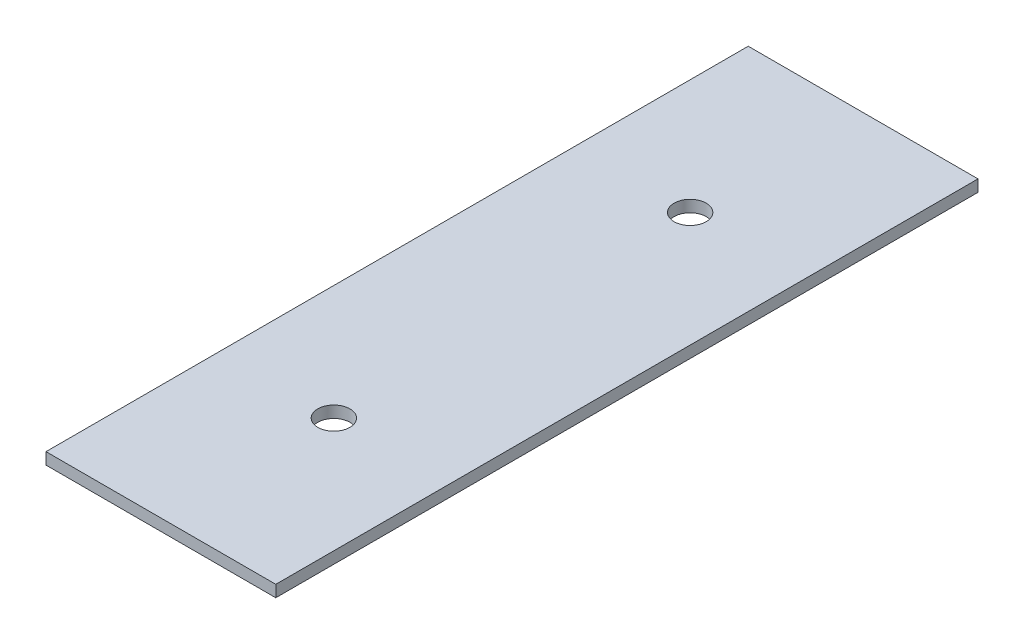
ISO-10303-21;
HEADER;
FILE_DESCRIPTION(('STEP AP214'),'2;1');
FILE_NAME('part.step','',(''),(''),'','','');
FILE_SCHEMA(('AUTOMOTIVE_DESIGN { 1 0 10303 214 1 1 1 1 }'));
ENDSEC;
DATA;
#1=APPLICATION_CONTEXT('core data for automotive mechanical design processes');
#2=APPLICATION_PROTOCOL_DEFINITION('international standard','automotive_design',2000,#1);
#3=PRODUCT_CONTEXT('',#1,'mechanical');
#4=PRODUCT('Part','Part','',(#3));
#5=PRODUCT_RELATED_PRODUCT_CATEGORY('part','',(#4));
#6=PRODUCT_DEFINITION_FORMATION('','',#4);
#7=PRODUCT_DEFINITION_CONTEXT('part definition',#1,'design');
#8=PRODUCT_DEFINITION('design','',#6,#7);
#9=PRODUCT_DEFINITION_SHAPE('','',#8);
#10=(LENGTH_UNIT() NAMED_UNIT(*) SI_UNIT(.MILLI.,.METRE.));
#11=(NAMED_UNIT(*) PLANE_ANGLE_UNIT() SI_UNIT($,.RADIAN.));
#12=(NAMED_UNIT(*) SI_UNIT($,.STERADIAN.) SOLID_ANGLE_UNIT());
#13=UNCERTAINTY_MEASURE_WITH_UNIT(LENGTH_MEASURE(1.E-05),#10,'distance_accuracy_value','');
#14=(GEOMETRIC_REPRESENTATION_CONTEXT(3) GLOBAL_UNCERTAINTY_ASSIGNED_CONTEXT((#13)) GLOBAL_UNIT_ASSIGNED_CONTEXT((#10,
#11,#12)) REPRESENTATION_CONTEXT('',''));
#15=CARTESIAN_POINT('',(0.,0.,0.));
#16=DIRECTION('',(0.,0.,1.));
#17=DIRECTION('',(1.,0.,0.));
#18=AXIS2_PLACEMENT_3D('',#15,#16,#17);
#19=CARTESIAN_POINT('',(9.83499526345136,-23.5,30.0573390699641));
#20=DIRECTION('',(-1.,0.,0.));
#21=DIRECTION('',(0.,0.,1.));
#22=AXIS2_PLACEMENT_3D('',#19,#20,#21);
#23=PLANE('',#22);
#24=DIRECTION('',(0.,0.,-1.));
#25=VECTOR('',#24,1.);
#26=CARTESIAN_POINT('',(9.83499526345136,-24.5,30.0573390699641));
#27=LINE('',#26,#25);
#28=CARTESIAN_POINT('',(9.83499526345136,-24.5,30.0573390699641));
#29=VERTEX_POINT('',#28);
#30=CARTESIAN_POINT('',(9.83499526345136,-24.5,-30.0573390699641));
#31=VERTEX_POINT('',#30);
#32=EDGE_CURVE('E98',#29,#31,#27,.T.);
#33=ORIENTED_EDGE('',*,*,#32,.T.);
#34=DIRECTION('',(0.,-1.,0.));
#35=VECTOR('',#34,1.);
#36=CARTESIAN_POINT('',(9.83499526345136,-23.5,-30.0573390699641));
#37=LINE('',#36,#35);
#38=CARTESIAN_POINT('',(9.83499526345136,-23.5,-30.0573390699641));
#39=VERTEX_POINT('',#38);
#40=EDGE_CURVE('E11',#39,#31,#37,.T.);
#41=ORIENTED_EDGE('',*,*,#40,.F.);
#42=DIRECTION('',(0.,0.,-1.));
#43=VECTOR('',#42,1.);
#44=CARTESIAN_POINT('',(9.83499526345136,-23.5,30.0573390699641));
#45=LINE('',#44,#43);
#46=CARTESIAN_POINT('',(9.83499526345136,-23.5,30.0573390699641));
#47=VERTEX_POINT('',#46);
#48=EDGE_CURVE('E85',#47,#39,#45,.T.);
#49=ORIENTED_EDGE('',*,*,#48,.F.);
#50=DIRECTION('',(0.,-1.,0.));
#51=VECTOR('',#50,1.);
#52=CARTESIAN_POINT('',(9.83499526345136,-23.5,30.0573390699641));
#53=LINE('',#52,#51);
#54=EDGE_CURVE('E94',#47,#29,#53,.T.);
#55=ORIENTED_EDGE('',*,*,#54,.T.);
#56=EDGE_LOOP('',(#33,#41,#49,#55));
#57=FACE_BOUND('',#56,.T.);
#58=ADVANCED_FACE('F32',(#57),#23,.F.);
#59=CARTESIAN_POINT('',(-9.83499526345136,-23.5,-30.0573390699641));
#60=DIRECTION('',(0.,0.,1.));
#61=DIRECTION('',(1.,0.,0.));
#62=AXIS2_PLACEMENT_3D('',#59,#60,#61);
#63=PLANE('',#62);
#64=DIRECTION('',(-1.,0.,0.));
#65=VECTOR('',#64,1.);
#66=CARTESIAN_POINT('',(-9.83499526345136,-24.5,-30.0573390699641));
#67=LINE('',#66,#65);
#68=CARTESIAN_POINT('',(-9.83499526345136,-24.5,-30.0573390699641));
#69=VERTEX_POINT('',#68);
#70=EDGE_CURVE('E89',#31,#69,#67,.T.);
#71=ORIENTED_EDGE('',*,*,#70,.T.);
#72=DIRECTION('',(0.,-1.,0.));
#73=VECTOR('',#72,1.);
#74=CARTESIAN_POINT('',(-9.83499526345136,-23.5,-30.0573390699641));
#75=LINE('',#74,#73);
#76=CARTESIAN_POINT('',(-9.83499526345136,-23.5,-30.0573390699641));
#77=VERTEX_POINT('',#76);
#78=EDGE_CURVE('E41',#77,#69,#75,.T.);
#79=ORIENTED_EDGE('',*,*,#78,.F.);
#80=DIRECTION('',(-1.,0.,0.));
#81=VECTOR('',#80,1.);
#82=CARTESIAN_POINT('',(-9.83499526345136,-23.5,-30.0573390699641));
#83=LINE('',#82,#81);
#84=EDGE_CURVE('E80',#39,#77,#83,.T.);
#85=ORIENTED_EDGE('',*,*,#84,.F.);
#86=ORIENTED_EDGE('',*,*,#40,.T.);
#87=EDGE_LOOP('',(#71,#79,#85,#86));
#88=FACE_BOUND('',#87,.T.);
#89=ADVANCED_FACE('F88',(#88),#63,.F.);
#90=CARTESIAN_POINT('',(-9.83499526345136,-23.5,30.0573390699641));
#91=DIRECTION('',(1.,0.,0.));
#92=DIRECTION('',(0.,0.,-1.));
#93=AXIS2_PLACEMENT_3D('',#90,#91,#92);
#94=PLANE('',#93);
#95=DIRECTION('',(0.,0.,1.));
#96=VECTOR('',#95,1.);
#97=CARTESIAN_POINT('',(-9.83499526345136,-24.5,30.0573390699641));
#98=LINE('',#97,#96);
#99=CARTESIAN_POINT('',(-9.83499526345136,-24.5,30.0573390699641));
#100=VERTEX_POINT('',#99);
#101=EDGE_CURVE('E67',#69,#100,#98,.T.);
#102=ORIENTED_EDGE('',*,*,#101,.T.);
#103=DIRECTION('',(0.,-1.,0.));
#104=VECTOR('',#103,1.);
#105=CARTESIAN_POINT('',(-9.83499526345136,-23.5,30.0573390699641));
#106=LINE('',#105,#104);
#107=CARTESIAN_POINT('',(-9.83499526345136,-23.5,30.0573390699641));
#108=VERTEX_POINT('',#107);
#109=EDGE_CURVE('E90',#108,#100,#106,.T.);
#110=ORIENTED_EDGE('',*,*,#109,.F.);
#111=DIRECTION('',(0.,0.,1.));
#112=VECTOR('',#111,1.);
#113=CARTESIAN_POINT('',(-9.83499526345136,-23.5,30.0573390699641));
#114=LINE('',#113,#112);
#115=EDGE_CURVE('E83',#77,#108,#114,.T.);
#116=ORIENTED_EDGE('',*,*,#115,.F.);
#117=ORIENTED_EDGE('',*,*,#78,.T.);
#118=EDGE_LOOP('',(#102,#110,#116,#117));
#119=FACE_BOUND('',#118,.T.);
#120=ADVANCED_FACE('F92',(#119),#94,.F.);
#121=CARTESIAN_POINT('',(-9.83499526345136,-23.5,30.0573390699641));
#122=DIRECTION('',(0.,0.,-1.));
#123=DIRECTION('',(-1.,0.,0.));
#124=AXIS2_PLACEMENT_3D('',#121,#122,#123);
#125=PLANE('',#124);
#126=DIRECTION('',(1.,0.,0.));
#127=VECTOR('',#126,1.);
#128=CARTESIAN_POINT('',(-9.83499526345136,-24.5,30.0573390699641));
#129=LINE('',#128,#127);
#130=EDGE_CURVE('E73',#100,#29,#129,.T.);
#131=ORIENTED_EDGE('',*,*,#130,.T.);
#132=ORIENTED_EDGE('',*,*,#54,.F.);
#133=DIRECTION('',(1.,0.,0.));
#134=VECTOR('',#133,1.);
#135=CARTESIAN_POINT('',(-9.83499526345136,-23.5,30.0573390699641));
#136=LINE('',#135,#134);
#137=EDGE_CURVE('E50',#108,#47,#136,.T.);
#138=ORIENTED_EDGE('',*,*,#137,.F.);
#139=ORIENTED_EDGE('',*,*,#109,.T.);
#140=EDGE_LOOP('',(#131,#132,#138,#139));
#141=FACE_BOUND('',#140,.T.);
#142=ADVANCED_FACE('F124',(#141),#125,.F.);
#143=CARTESIAN_POINT('',(0.,-23.5,0.));
#144=DIRECTION('',(0.,-1.,0.));
#145=DIRECTION('',(0.,0.,-1.));
#146=AXIS2_PLACEMENT_3D('',#143,#144,#145);
#147=PLANE('',#146);
#148=CARTESIAN_POINT('',(0.,-23.5,15.25));
#149=DIRECTION('',(0.,1.,0.));
#150=DIRECTION('',(0.,0.,1.));
#151=AXIS2_PLACEMENT_3D('',#148,#149,#150);
#152=CIRCLE('',#151,1.375);
#153=CARTESIAN_POINT('',(0.,-23.5,16.625));
#154=VERTEX_POINT('',#153);
#155=EDGE_CURVE('E107',#154,#154,#152,.T.);
#156=ORIENTED_EDGE('',*,*,#155,.F.);
#157=EDGE_LOOP('',(#156));
#158=FACE_BOUND('',#157,.T.);
#159=CARTESIAN_POINT('',(0.,-23.5,-15.25));
#160=DIRECTION('',(0.,1.,0.));
#161=DIRECTION('',(0.,0.,1.));
#162=AXIS2_PLACEMENT_3D('',#159,#160,#161);
#163=CIRCLE('',#162,1.375);
#164=CARTESIAN_POINT('',(0.,-23.5,-13.875));
#165=VERTEX_POINT('',#164);
#166=EDGE_CURVE('E112',#165,#165,#163,.T.);
#167=ORIENTED_EDGE('',*,*,#166,.F.);
#168=EDGE_LOOP('',(#167));
#169=FACE_BOUND('',#168,.T.);
#170=ORIENTED_EDGE('',*,*,#48,.T.);
#171=ORIENTED_EDGE('',*,*,#84,.T.);
#172=ORIENTED_EDGE('',*,*,#115,.T.);
#173=ORIENTED_EDGE('',*,*,#137,.T.);
#174=EDGE_LOOP('',(#170,#171,#172,#173));
#175=FACE_BOUND('',#174,.T.);
#176=ADVANCED_FACE('F81',(#158,#169,#175),#147,.F.);
#177=CARTESIAN_POINT('',(0.,-24.5,0.));
#178=DIRECTION('',(0.,-1.,0.));
#179=DIRECTION('',(0.,0.,-1.));
#180=AXIS2_PLACEMENT_3D('',#177,#178,#179);
#181=PLANE('',#180);
#182=CARTESIAN_POINT('',(0.,-24.5,15.25));
#183=DIRECTION('',(0.,-1.,0.));
#184=DIRECTION('',(0.,0.,-1.));
#185=AXIS2_PLACEMENT_3D('',#182,#183,#184);
#186=CIRCLE('',#185,1.375);
#187=CARTESIAN_POINT('',(0.,-24.5,13.875));
#188=VERTEX_POINT('',#187);
#189=EDGE_CURVE('E35',#188,#188,#186,.T.);
#190=ORIENTED_EDGE('',*,*,#189,.F.);
#191=EDGE_LOOP('',(#190));
#192=FACE_BOUND('',#191,.T.);
#193=CARTESIAN_POINT('',(0.,-24.5,-15.25));
#194=DIRECTION('',(0.,-1.,0.));
#195=DIRECTION('',(0.,0.,-1.));
#196=AXIS2_PLACEMENT_3D('',#193,#194,#195);
#197=CIRCLE('',#196,1.375);
#198=CARTESIAN_POINT('',(0.,-24.5,-16.625));
#199=VERTEX_POINT('',#198);
#200=EDGE_CURVE('E105',#199,#199,#197,.T.);
#201=ORIENTED_EDGE('',*,*,#200,.F.);
#202=EDGE_LOOP('',(#201));
#203=FACE_BOUND('',#202,.T.);
#204=ORIENTED_EDGE('',*,*,#32,.F.);
#205=ORIENTED_EDGE('',*,*,#130,.F.);
#206=ORIENTED_EDGE('',*,*,#101,.F.);
#207=ORIENTED_EDGE('',*,*,#70,.F.);
#208=EDGE_LOOP('',(#204,#205,#206,#207));
#209=FACE_BOUND('',#208,.T.);
#210=ADVANCED_FACE('F123',(#192,#203,#209),#181,.T.);
#211=CARTESIAN_POINT('',(0.,-29.5,-15.25));
#212=DIRECTION('',(0.,1.,0.));
#213=DIRECTION('',(0.,0.,1.));
#214=AXIS2_PLACEMENT_3D('',#211,#212,#213);
#215=CYLINDRICAL_SURFACE('',#214,1.375);
#216=ORIENTED_EDGE('',*,*,#200,.T.);
#217=EDGE_LOOP('',(#216));
#218=FACE_BOUND('',#217,.T.);
#219=ORIENTED_EDGE('',*,*,#166,.T.);
#220=EDGE_LOOP('',(#219));
#221=FACE_BOUND('',#220,.T.);
#222=ADVANCED_FACE('F120',(#218,#221),#215,.F.);
#223=CARTESIAN_POINT('',(0.,-29.5,15.25));
#224=DIRECTION('',(0.,1.,0.));
#225=DIRECTION('',(0.,0.,1.));
#226=AXIS2_PLACEMENT_3D('',#223,#224,#225);
#227=CYLINDRICAL_SURFACE('',#226,1.375);
#228=ORIENTED_EDGE('',*,*,#189,.T.);
#229=EDGE_LOOP('',(#228));
#230=FACE_BOUND('',#229,.T.);
#231=ORIENTED_EDGE('',*,*,#155,.T.);
#232=EDGE_LOOP('',(#231));
#233=FACE_BOUND('',#232,.T.);
#234=ADVANCED_FACE('F174',(#230,#233),#227,.F.);
#235=CLOSED_SHELL('',(#58,#89,#120,#142,#176,#210,#222,#234));
#236=MANIFOLD_SOLID_BREP('B2',#235);
#237=ADVANCED_BREP_SHAPE_REPRESENTATION('',(#18,#236),#14);
#238=SHAPE_DEFINITION_REPRESENTATION(#9,#237);
ENDSEC;
END-ISO-10303-21;
